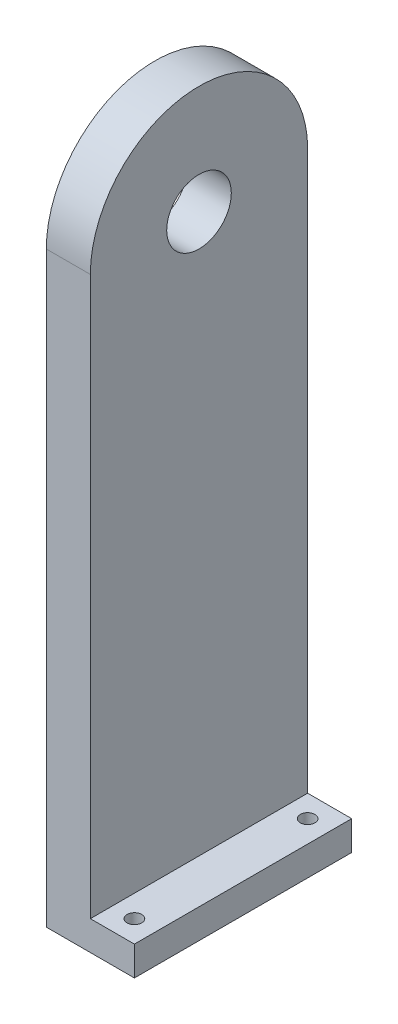
ISO-10303-21;
HEADER;
FILE_DESCRIPTION(('STEP AP214'),'2;1');
FILE_NAME('part.step','',(''),(''),'','','');
FILE_SCHEMA(('AUTOMOTIVE_DESIGN { 1 0 10303 214 1 1 1 1 }'));
ENDSEC;
DATA;
#1=APPLICATION_CONTEXT('core data for automotive mechanical design processes');
#2=APPLICATION_PROTOCOL_DEFINITION('international standard','automotive_design',2000,#1);
#3=PRODUCT_CONTEXT('',#1,'mechanical');
#4=PRODUCT('Part','Part','',(#3));
#5=PRODUCT_RELATED_PRODUCT_CATEGORY('part','',(#4));
#6=PRODUCT_DEFINITION_FORMATION('','',#4);
#7=PRODUCT_DEFINITION_CONTEXT('part definition',#1,'design');
#8=PRODUCT_DEFINITION('design','',#6,#7);
#9=PRODUCT_DEFINITION_SHAPE('','',#8);
#10=(LENGTH_UNIT() NAMED_UNIT(*) SI_UNIT(.MILLI.,.METRE.));
#11=(NAMED_UNIT(*) PLANE_ANGLE_UNIT() SI_UNIT($,.RADIAN.));
#12=(NAMED_UNIT(*) SI_UNIT($,.STERADIAN.) SOLID_ANGLE_UNIT());
#13=UNCERTAINTY_MEASURE_WITH_UNIT(LENGTH_MEASURE(1.E-05),#10,'distance_accuracy_value','');
#14=(GEOMETRIC_REPRESENTATION_CONTEXT(3) GLOBAL_UNCERTAINTY_ASSIGNED_CONTEXT((#13)) GLOBAL_UNIT_ASSIGNED_CONTEXT((#10,
#11,#12)) REPRESENTATION_CONTEXT('',''));
#15=CARTESIAN_POINT('',(0.,0.,0.));
#16=DIRECTION('',(0.,0.,1.));
#17=DIRECTION('',(1.,0.,0.));
#18=AXIS2_PLACEMENT_3D('',#15,#16,#17);
#19=CARTESIAN_POINT('',(15.,0.,0.));
#20=DIRECTION('',(1.,0.,0.));
#21=DIRECTION('',(0.,0.,-1.));
#22=AXIS2_PLACEMENT_3D('',#19,#20,#21);
#23=PLANE('',#22);
#24=CARTESIAN_POINT('',(15.,0.,0.));
#25=DIRECTION('',(1.,0.,0.));
#26=DIRECTION('',(0.,0.,-1.));
#27=AXIS2_PLACEMENT_3D('',#24,#25,#26);
#28=CIRCLE('',#27,11.);
#29=CARTESIAN_POINT('',(15.,0.,-11.));
#30=VERTEX_POINT('',#29);
#31=EDGE_CURVE('E174',#30,#30,#28,.T.);
#32=ORIENTED_EDGE('',*,*,#31,.F.);
#33=EDGE_LOOP('',(#32));
#34=FACE_BOUND('',#33,.T.);
#35=DIRECTION('',(0.,-1.,0.));
#36=VECTOR('',#35,1.);
#37=CARTESIAN_POINT('',(15.,0.,37.));
#38=LINE('',#37,#36);
#39=CARTESIAN_POINT('',(15.,0.,37.));
#40=VERTEX_POINT('',#39);
#41=CARTESIAN_POINT('',(15.,-190.,37.));
#42=VERTEX_POINT('',#41);
#43=EDGE_CURVE('E159',#40,#42,#38,.T.);
#44=ORIENTED_EDGE('',*,*,#43,.T.);
#45=DIRECTION('',(0.,0.,-1.));
#46=VECTOR('',#45,1.);
#47=CARTESIAN_POINT('',(15.,-190.,37.));
#48=LINE('',#47,#46);
#49=CARTESIAN_POINT('',(15.,-190.,-37.));
#50=VERTEX_POINT('',#49);
#51=EDGE_CURVE('E147',#42,#50,#48,.T.);
#52=ORIENTED_EDGE('',*,*,#51,.T.);
#53=DIRECTION('',(0.,1.,0.));
#54=VECTOR('',#53,1.);
#55=CARTESIAN_POINT('',(15.,-200.,-37.));
#56=LINE('',#55,#54);
#57=CARTESIAN_POINT('',(15.,0.,-37.));
#58=VERTEX_POINT('',#57);
#59=EDGE_CURVE('E62',#50,#58,#56,.T.);
#60=ORIENTED_EDGE('',*,*,#59,.T.);
#61=CARTESIAN_POINT('',(15.,0.,0.));
#62=DIRECTION('',(1.,0.,0.));
#63=DIRECTION('',(0.,0.,-1.));
#64=AXIS2_PLACEMENT_3D('',#61,#62,#63);
#65=CIRCLE('',#64,37.);
#66=EDGE_CURVE('E94',#58,#40,#65,.T.);
#67=ORIENTED_EDGE('',*,*,#66,.T.);
#68=EDGE_LOOP('',(#44,#52,#60,#67));
#69=FACE_BOUND('',#68,.T.);
#70=ADVANCED_FACE('F38',(#34,#69),#23,.T.);
#71=CARTESIAN_POINT('',(15.,0.,0.));
#72=DIRECTION('',(-1.,0.,0.));
#73=DIRECTION('',(0.,0.,1.));
#74=AXIS2_PLACEMENT_3D('',#71,#72,#73);
#75=CYLINDRICAL_SURFACE('',#74,37.);
#76=CARTESIAN_POINT('',(0.,0.,0.));
#77=DIRECTION('',(1.,0.,0.));
#78=DIRECTION('',(0.,0.,-1.));
#79=AXIS2_PLACEMENT_3D('',#76,#77,#78);
#80=CIRCLE('',#79,37.);
#81=CARTESIAN_POINT('',(0.,0.,-37.));
#82=VERTEX_POINT('',#81);
#83=CARTESIAN_POINT('',(0.,0.,37.));
#84=VERTEX_POINT('',#83);
#85=EDGE_CURVE('E100',#82,#84,#80,.T.);
#86=ORIENTED_EDGE('',*,*,#85,.T.);
#87=DIRECTION('',(-1.,0.,0.));
#88=VECTOR('',#87,1.);
#89=CARTESIAN_POINT('',(15.,0.,37.));
#90=LINE('',#89,#88);
#91=EDGE_CURVE('E11',#40,#84,#90,.T.);
#92=ORIENTED_EDGE('',*,*,#91,.F.);
#93=ORIENTED_EDGE('',*,*,#66,.F.);
#94=DIRECTION('',(-1.,0.,0.));
#95=VECTOR('',#94,1.);
#96=CARTESIAN_POINT('',(15.,0.,-37.));
#97=LINE('',#96,#95);
#98=EDGE_CURVE('E85',#58,#82,#97,.T.);
#99=ORIENTED_EDGE('',*,*,#98,.T.);
#100=EDGE_LOOP('',(#86,#92,#93,#99));
#101=FACE_BOUND('',#100,.T.);
#102=ADVANCED_FACE('F40',(#101),#75,.T.);
#103=CARTESIAN_POINT('',(15.,0.,37.));
#104=DIRECTION('',(0.,0.,-1.));
#105=DIRECTION('',(0.,1.,0.));
#106=AXIS2_PLACEMENT_3D('',#103,#104,#105);
#107=PLANE('',#106);
#108=DIRECTION('',(0.,-1.,0.));
#109=VECTOR('',#108,1.);
#110=CARTESIAN_POINT('',(0.,0.,37.));
#111=LINE('',#110,#109);
#112=CARTESIAN_POINT('',(0.,-200.,37.));
#113=VERTEX_POINT('',#112);
#114=EDGE_CURVE('E104',#84,#113,#111,.T.);
#115=ORIENTED_EDGE('',*,*,#114,.T.);
#116=DIRECTION('',(-1.,0.,0.));
#117=VECTOR('',#116,1.);
#118=CARTESIAN_POINT('',(15.,-200.,37.));
#119=LINE('',#118,#117);
#120=CARTESIAN_POINT('',(30.,-200.,37.));
#121=VERTEX_POINT('',#120);
#122=EDGE_CURVE('E47',#121,#113,#119,.T.);
#123=ORIENTED_EDGE('',*,*,#122,.F.);
#124=DIRECTION('',(0.,-1.,0.));
#125=VECTOR('',#124,1.);
#126=CARTESIAN_POINT('',(30.,-190.,37.));
#127=LINE('',#126,#125);
#128=CARTESIAN_POINT('',(30.,-190.,37.));
#129=VERTEX_POINT('',#128);
#130=EDGE_CURVE('E106',#129,#121,#127,.T.);
#131=ORIENTED_EDGE('',*,*,#130,.F.);
#132=DIRECTION('',(-1.,0.,0.));
#133=VECTOR('',#132,1.);
#134=CARTESIAN_POINT('',(15.,-190.,37.));
#135=LINE('',#134,#133);
#136=EDGE_CURVE('E144',#129,#42,#135,.T.);
#137=ORIENTED_EDGE('',*,*,#136,.T.);
#138=ORIENTED_EDGE('',*,*,#43,.F.);
#139=ORIENTED_EDGE('',*,*,#91,.T.);
#140=EDGE_LOOP('',(#115,#123,#131,#137,#138,#139));
#141=FACE_BOUND('',#140,.T.);
#142=ADVANCED_FACE('F131',(#141),#107,.F.);
#143=CARTESIAN_POINT('',(15.,-200.,37.));
#144=DIRECTION('',(0.,1.,0.));
#145=DIRECTION('',(0.,0.,1.));
#146=AXIS2_PLACEMENT_3D('',#143,#144,#145);
#147=PLANE('',#146);
#148=CARTESIAN_POINT('',(22.5,-200.,29.5));
#149=DIRECTION('',(0.,-1.,0.));
#150=DIRECTION('',(0.,0.,-1.));
#151=AXIS2_PLACEMENT_3D('',#148,#149,#150);
#152=CIRCLE('',#151,2.5);
#153=CARTESIAN_POINT('',(22.5,-200.,27.));
#154=VERTEX_POINT('',#153);
#155=EDGE_CURVE('E178',#154,#154,#152,.T.);
#156=ORIENTED_EDGE('',*,*,#155,.F.);
#157=EDGE_LOOP('',(#156));
#158=FACE_BOUND('',#157,.T.);
#159=CARTESIAN_POINT('',(22.5,-200.,-29.5));
#160=DIRECTION('',(0.,-1.,0.));
#161=DIRECTION('',(0.,0.,-1.));
#162=AXIS2_PLACEMENT_3D('',#159,#160,#161);
#163=CIRCLE('',#162,2.5);
#164=CARTESIAN_POINT('',(22.5,-200.,-32.));
#165=VERTEX_POINT('',#164);
#166=EDGE_CURVE('E169',#165,#165,#163,.T.);
#167=ORIENTED_EDGE('',*,*,#166,.F.);
#168=EDGE_LOOP('',(#167));
#169=FACE_BOUND('',#168,.T.);
#170=DIRECTION('',(0.,0.,-1.));
#171=VECTOR('',#170,1.);
#172=CARTESIAN_POINT('',(0.,-200.,37.));
#173=LINE('',#172,#171);
#174=CARTESIAN_POINT('',(0.,-200.,-37.));
#175=VERTEX_POINT('',#174);
#176=EDGE_CURVE('E95',#113,#175,#173,.T.);
#177=ORIENTED_EDGE('',*,*,#176,.T.);
#178=DIRECTION('',(-1.,0.,0.));
#179=VECTOR('',#178,1.);
#180=CARTESIAN_POINT('',(15.,-200.,-37.));
#181=LINE('',#180,#179);
#182=CARTESIAN_POINT('',(30.,-200.,-37.));
#183=VERTEX_POINT('',#182);
#184=EDGE_CURVE('E89',#183,#175,#181,.T.);
#185=ORIENTED_EDGE('',*,*,#184,.F.);
#186=DIRECTION('',(0.,0.,1.));
#187=VECTOR('',#186,1.);
#188=CARTESIAN_POINT('',(30.,-200.,37.));
#189=LINE('',#188,#187);
#190=EDGE_CURVE('E128',#183,#121,#189,.T.);
#191=ORIENTED_EDGE('',*,*,#190,.T.);
#192=ORIENTED_EDGE('',*,*,#122,.T.);
#193=EDGE_LOOP('',(#177,#185,#191,#192));
#194=FACE_BOUND('',#193,.T.);
#195=ADVANCED_FACE('F125',(#158,#169,#194),#147,.F.);
#196=CARTESIAN_POINT('',(15.,-200.,-37.));
#197=DIRECTION('',(0.,0.,1.));
#198=DIRECTION('',(0.,-1.,0.));
#199=AXIS2_PLACEMENT_3D('',#196,#197,#198);
#200=PLANE('',#199);
#201=DIRECTION('',(0.,1.,0.));
#202=VECTOR('',#201,1.);
#203=CARTESIAN_POINT('',(0.,-200.,-37.));
#204=LINE('',#203,#202);
#205=EDGE_CURVE('E82',#175,#82,#204,.T.);
#206=ORIENTED_EDGE('',*,*,#205,.T.);
#207=ORIENTED_EDGE('',*,*,#98,.F.);
#208=ORIENTED_EDGE('',*,*,#59,.F.);
#209=DIRECTION('',(1.,0.,0.));
#210=VECTOR('',#209,1.);
#211=CARTESIAN_POINT('',(15.,-190.,-37.));
#212=LINE('',#211,#210);
#213=CARTESIAN_POINT('',(30.,-190.,-37.));
#214=VERTEX_POINT('',#213);
#215=EDGE_CURVE('E54',#50,#214,#212,.T.);
#216=ORIENTED_EDGE('',*,*,#215,.T.);
#217=DIRECTION('',(0.,-1.,0.));
#218=VECTOR('',#217,1.);
#219=CARTESIAN_POINT('',(30.,-190.,-37.));
#220=LINE('',#219,#218);
#221=EDGE_CURVE('E112',#214,#183,#220,.T.);
#222=ORIENTED_EDGE('',*,*,#221,.T.);
#223=ORIENTED_EDGE('',*,*,#184,.T.);
#224=EDGE_LOOP('',(#206,#207,#208,#216,#222,#223));
#225=FACE_BOUND('',#224,.T.);
#226=ADVANCED_FACE('F84',(#225),#200,.F.);
#227=CARTESIAN_POINT('',(0.,0.,0.));
#228=DIRECTION('',(1.,0.,0.));
#229=DIRECTION('',(0.,0.,-1.));
#230=AXIS2_PLACEMENT_3D('',#227,#228,#229);
#231=PLANE('',#230);
#232=CARTESIAN_POINT('',(0.,0.,0.));
#233=DIRECTION('',(-1.,0.,0.));
#234=DIRECTION('',(0.,0.,1.));
#235=AXIS2_PLACEMENT_3D('',#232,#233,#234);
#236=CIRCLE('',#235,11.);
#237=CARTESIAN_POINT('',(0.,0.,11.));
#238=VERTEX_POINT('',#237);
#239=EDGE_CURVE('E188',#238,#238,#236,.T.);
#240=ORIENTED_EDGE('',*,*,#239,.F.);
#241=EDGE_LOOP('',(#240));
#242=FACE_BOUND('',#241,.T.);
#243=ORIENTED_EDGE('',*,*,#85,.F.);
#244=ORIENTED_EDGE('',*,*,#205,.F.);
#245=ORIENTED_EDGE('',*,*,#176,.F.);
#246=ORIENTED_EDGE('',*,*,#114,.F.);
#247=EDGE_LOOP('',(#243,#244,#245,#246));
#248=FACE_BOUND('',#247,.T.);
#249=ADVANCED_FACE('F103',(#242,#248),#231,.F.);
#250=CARTESIAN_POINT('',(30.,-190.,37.));
#251=DIRECTION('',(1.,0.,0.));
#252=DIRECTION('',(0.,0.,-1.));
#253=AXIS2_PLACEMENT_3D('',#250,#251,#252);
#254=PLANE('',#253);
#255=ORIENTED_EDGE('',*,*,#190,.F.);
#256=ORIENTED_EDGE('',*,*,#221,.F.);
#257=DIRECTION('',(0.,0.,1.));
#258=VECTOR('',#257,1.);
#259=CARTESIAN_POINT('',(30.,-190.,37.));
#260=LINE('',#259,#258);
#261=EDGE_CURVE('E140',#214,#129,#260,.T.);
#262=ORIENTED_EDGE('',*,*,#261,.T.);
#263=ORIENTED_EDGE('',*,*,#130,.T.);
#264=EDGE_LOOP('',(#255,#256,#262,#263));
#265=FACE_BOUND('',#264,.T.);
#266=ADVANCED_FACE('F138',(#265),#254,.T.);
#267=CARTESIAN_POINT('',(0.,-190.,0.));
#268=DIRECTION('',(0.,-1.,0.));
#269=DIRECTION('',(0.,0.,-1.));
#270=AXIS2_PLACEMENT_3D('',#267,#268,#269);
#271=PLANE('',#270);
#272=CARTESIAN_POINT('',(22.5,-190.,29.5));
#273=DIRECTION('',(0.,-1.,0.));
#274=DIRECTION('',(0.,0.,-1.));
#275=AXIS2_PLACEMENT_3D('',#272,#273,#274);
#276=CIRCLE('',#275,2.5);
#277=CARTESIAN_POINT('',(22.5,-190.,27.));
#278=VERTEX_POINT('',#277);
#279=EDGE_CURVE('E156',#278,#278,#276,.T.);
#280=ORIENTED_EDGE('',*,*,#279,.T.);
#281=EDGE_LOOP('',(#280));
#282=FACE_BOUND('',#281,.T.);
#283=CARTESIAN_POINT('',(22.5,-190.,-29.5));
#284=DIRECTION('',(0.,-1.,0.));
#285=DIRECTION('',(0.,0.,-1.));
#286=AXIS2_PLACEMENT_3D('',#283,#284,#285);
#287=CIRCLE('',#286,2.5);
#288=CARTESIAN_POINT('',(22.5,-190.,-32.));
#289=VERTEX_POINT('',#288);
#290=EDGE_CURVE('E173',#289,#289,#287,.T.);
#291=ORIENTED_EDGE('',*,*,#290,.T.);
#292=EDGE_LOOP('',(#291));
#293=FACE_BOUND('',#292,.T.);
#294=ORIENTED_EDGE('',*,*,#51,.F.);
#295=ORIENTED_EDGE('',*,*,#136,.F.);
#296=ORIENTED_EDGE('',*,*,#261,.F.);
#297=ORIENTED_EDGE('',*,*,#215,.F.);
#298=EDGE_LOOP('',(#294,#295,#296,#297));
#299=FACE_BOUND('',#298,.T.);
#300=ADVANCED_FACE('F146',(#282,#293,#299),#271,.F.);
#301=CARTESIAN_POINT('',(22.5,-190.,-29.5));
#302=DIRECTION('',(0.,-1.,0.));
#303=DIRECTION('',(0.,0.,-1.));
#304=AXIS2_PLACEMENT_3D('',#301,#302,#303);
#305=CYLINDRICAL_SURFACE('',#304,2.5);
#306=ORIENTED_EDGE('',*,*,#290,.F.);
#307=EDGE_LOOP('',(#306));
#308=FACE_BOUND('',#307,.T.);
#309=ORIENTED_EDGE('',*,*,#166,.T.);
#310=EDGE_LOOP('',(#309));
#311=FACE_BOUND('',#310,.T.);
#312=ADVANCED_FACE('F213',(#308,#311),#305,.F.);
#313=CARTESIAN_POINT('',(22.5,-190.,29.5));
#314=DIRECTION('',(0.,-1.,0.));
#315=DIRECTION('',(0.,0.,-1.));
#316=AXIS2_PLACEMENT_3D('',#313,#314,#315);
#317=CYLINDRICAL_SURFACE('',#316,2.5);
#318=ORIENTED_EDGE('',*,*,#279,.F.);
#319=EDGE_LOOP('',(#318));
#320=FACE_BOUND('',#319,.T.);
#321=ORIENTED_EDGE('',*,*,#155,.T.);
#322=EDGE_LOOP('',(#321));
#323=FACE_BOUND('',#322,.T.);
#324=ADVANCED_FACE('F217',(#320,#323),#317,.F.);
#325=CARTESIAN_POINT('',(30.,0.,0.));
#326=DIRECTION('',(-1.,0.,0.));
#327=DIRECTION('',(0.,0.,1.));
#328=AXIS2_PLACEMENT_3D('',#325,#326,#327);
#329=CYLINDRICAL_SURFACE('',#328,11.);
#330=ORIENTED_EDGE('',*,*,#31,.T.);
#331=EDGE_LOOP('',(#330));
#332=FACE_BOUND('',#331,.T.);
#333=ORIENTED_EDGE('',*,*,#239,.T.);
#334=EDGE_LOOP('',(#333));
#335=FACE_BOUND('',#334,.T.);
#336=ADVANCED_FACE('F193',(#332,#335),#329,.F.);
#337=CLOSED_SHELL('',(#70,#102,#142,#195,#226,#249,#266,#300,#312,#324,#336));
#338=MANIFOLD_SOLID_BREP('B2',#337);
#339=ADVANCED_BREP_SHAPE_REPRESENTATION('',(#18,#338),#14);
#340=SHAPE_DEFINITION_REPRESENTATION(#9,#339);
ENDSEC;
END-ISO-10303-21;
